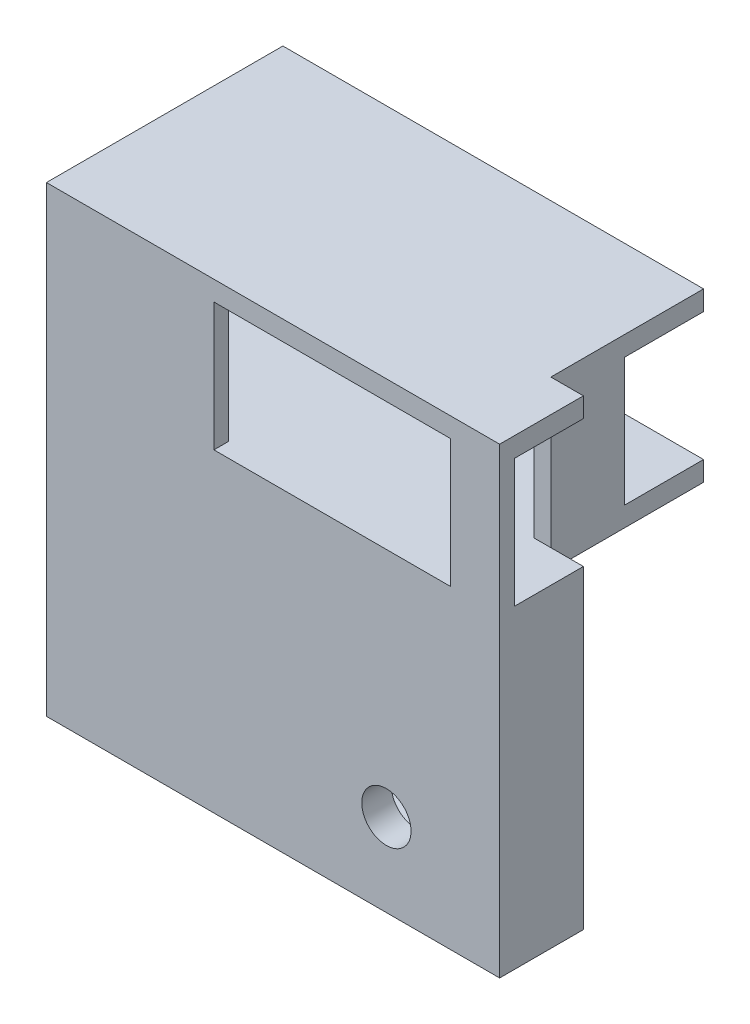
ISO-10303-21;
HEADER;
FILE_DESCRIPTION(('STEP AP214'),'2;1');
FILE_NAME('part.step','',(''),(''),'','','');
FILE_SCHEMA(('AUTOMOTIVE_DESIGN { 1 0 10303 214 1 1 1 1 }'));
ENDSEC;
DATA;
#1=APPLICATION_CONTEXT('core data for automotive mechanical design processes');
#2=APPLICATION_PROTOCOL_DEFINITION('international standard','automotive_design',2000,#1);
#3=PRODUCT_CONTEXT('',#1,'mechanical');
#4=PRODUCT('Part','Part','',(#3));
#5=PRODUCT_RELATED_PRODUCT_CATEGORY('part','',(#4));
#6=PRODUCT_DEFINITION_FORMATION('','',#4);
#7=PRODUCT_DEFINITION_CONTEXT('part definition',#1,'design');
#8=PRODUCT_DEFINITION('design','',#6,#7);
#9=PRODUCT_DEFINITION_SHAPE('','',#8);
#10=(LENGTH_UNIT() NAMED_UNIT(*) SI_UNIT(.MILLI.,.METRE.));
#11=(NAMED_UNIT(*) PLANE_ANGLE_UNIT() SI_UNIT($,.RADIAN.));
#12=(NAMED_UNIT(*) SI_UNIT($,.STERADIAN.) SOLID_ANGLE_UNIT());
#13=UNCERTAINTY_MEASURE_WITH_UNIT(LENGTH_MEASURE(1.E-05),#10,'distance_accuracy_value','');
#14=(GEOMETRIC_REPRESENTATION_CONTEXT(3) GLOBAL_UNCERTAINTY_ASSIGNED_CONTEXT((#13)) GLOBAL_UNIT_ASSIGNED_CONTEXT((#10,
#11,#12)) REPRESENTATION_CONTEXT('',''));
#15=CARTESIAN_POINT('',(0.,0.,0.));
#16=DIRECTION('',(0.,0.,1.));
#17=DIRECTION('',(1.,0.,0.));
#18=AXIS2_PLACEMENT_3D('',#15,#16,#17);
#19=CARTESIAN_POINT('',(0.,0.,0.));
#20=DIRECTION('',(0.,0.,-1.));
#21=DIRECTION('',(-1.,0.,0.));
#22=AXIS2_PLACEMENT_3D('',#19,#20,#21);
#23=PLANE('',#22);
#24=CARTESIAN_POINT('',(-26.6,3.,0.));
#25=DIRECTION('',(0.,0.,-1.));
#26=DIRECTION('',(-1.,0.,0.));
#27=AXIS2_PLACEMENT_3D('',#24,#25,#26);
#28=CIRCLE('',#27,1.);
#29=CARTESIAN_POINT('',(-27.6,3.,0.));
#30=VERTEX_POINT('',#29);
#31=EDGE_CURVE('E12',#30,#30,#28,.T.);
#32=ORIENTED_EDGE('',*,*,#31,.F.);
#33=EDGE_LOOP('',(#32));
#34=FACE_BOUND('',#33,.T.);
#35=CARTESIAN_POINT('',(-26.6,10.,0.));
#36=DIRECTION('',(0.,0.,-1.));
#37=DIRECTION('',(-1.,0.,0.));
#38=AXIS2_PLACEMENT_3D('',#35,#36,#37);
#39=CIRCLE('',#38,1.);
#40=CARTESIAN_POINT('',(-27.6,10.,0.));
#41=VERTEX_POINT('',#40);
#42=EDGE_CURVE('E73',#41,#41,#39,.T.);
#43=ORIENTED_EDGE('',*,*,#42,.F.);
#44=EDGE_LOOP('',(#43));
#45=FACE_BOUND('',#44,.T.);
#46=DIRECTION('',(1.,0.,0.));
#47=VECTOR('',#46,1.);
#48=CARTESIAN_POINT('',(-29.,0.,0.));
#49=LINE('',#48,#47);
#50=CARTESIAN_POINT('',(-38.,0.,0.));
#51=VERTEX_POINT('',#50);
#52=CARTESIAN_POINT('',(-24.,0.,0.));
#53=VERTEX_POINT('',#52);
#54=EDGE_CURVE('E433',#51,#53,#49,.T.);
#55=ORIENTED_EDGE('',*,*,#54,.F.);
#56=DIRECTION('',(0.,1.,0.));
#57=VECTOR('',#56,1.);
#58=CARTESIAN_POINT('',(-38.,0.,0.));
#59=LINE('',#58,#57);
#60=CARTESIAN_POINT('',(-38.,13.,0.));
#61=VERTEX_POINT('',#60);
#62=EDGE_CURVE('E325',#51,#61,#59,.T.);
#63=ORIENTED_EDGE('',*,*,#62,.T.);
#64=DIRECTION('',(-1.,0.,0.));
#65=VECTOR('',#64,1.);
#66=CARTESIAN_POINT('',(-29.,13.,0.));
#67=LINE('',#66,#65);
#68=CARTESIAN_POINT('',(-24.,13.,0.));
#69=VERTEX_POINT('',#68);
#70=EDGE_CURVE('E408',#69,#61,#67,.T.);
#71=ORIENTED_EDGE('',*,*,#70,.F.);
#72=DIRECTION('',(0.,1.,0.));
#73=VECTOR('',#72,1.);
#74=CARTESIAN_POINT('',(-24.,0.,0.));
#75=LINE('',#74,#73);
#76=EDGE_CURVE('E459',#53,#69,#75,.T.);
#77=ORIENTED_EDGE('',*,*,#76,.F.);
#78=EDGE_LOOP('',(#55,#63,#71,#77));
#79=FACE_BOUND('',#78,.T.);
#80=ADVANCED_FACE('F64',(#34,#45,#79),#23,.T.);
#81=CARTESIAN_POINT('',(5.00000000000001,-2.,1.5));
#82=DIRECTION('',(0.,-1.,0.));
#83=DIRECTION('',(1.,0.,0.));
#84=AXIS2_PLACEMENT_3D('',#81,#82,#83);
#85=PLANE('',#84);
#86=DIRECTION('',(1.,0.,0.));
#87=VECTOR('',#86,1.);
#88=CARTESIAN_POINT('',(0.,-2.,-7.));
#89=LINE('',#88,#87);
#90=CARTESIAN_POINT('',(-38.,-2.,-7.));
#91=VERTEX_POINT('',#90);
#92=CARTESIAN_POINT('',(1.69830011454754,-2.,-7.));
#93=VERTEX_POINT('',#92);
#94=EDGE_CURVE('E708',#91,#93,#89,.T.);
#95=ORIENTED_EDGE('',*,*,#94,.F.);
#96=DIRECTION('',(0.,0.,-1.));
#97=VECTOR('',#96,1.);
#98=CARTESIAN_POINT('',(-38.,-2.00000000000001,1.5));
#99=LINE('',#98,#97);
#100=CARTESIAN_POINT('',(-38.,-2.00000000000001,-22.5));
#101=VERTEX_POINT('',#100);
#102=EDGE_CURVE('E332',#91,#101,#99,.T.);
#103=ORIENTED_EDGE('',*,*,#102,.T.);
#104=DIRECTION('',(-1.,0.,0.));
#105=VECTOR('',#104,1.);
#106=CARTESIAN_POINT('',(0.,-2.00000000000001,-22.5));
#107=LINE('',#106,#105);
#108=CARTESIAN_POINT('',(1.69830011454754,-2.00000000000001,-22.5));
#109=VERTEX_POINT('',#108);
#110=EDGE_CURVE('E301',#109,#101,#107,.T.);
#111=ORIENTED_EDGE('',*,*,#110,.F.);
#112=DIRECTION('',(0.,0.,1.));
#113=VECTOR('',#112,1.);
#114=CARTESIAN_POINT('',(1.69830011454754,-2.00000000000001,-22.5));
#115=LINE('',#114,#113);
#116=EDGE_CURVE('E387',#109,#93,#115,.T.);
#117=ORIENTED_EDGE('',*,*,#116,.T.);
#118=EDGE_LOOP('',(#95,#103,#111,#117));
#119=FACE_BOUND('',#118,.T.);
#120=ADVANCED_FACE('F66',(#119),#85,.T.);
#121=CARTESIAN_POINT('',(0.,0.,1.5));
#122=DIRECTION('',(0.,-1.,0.));
#123=DIRECTION('',(0.,0.,-1.));
#124=AXIS2_PLACEMENT_3D('',#121,#122,#123);
#125=PLANE('',#124);
#126=DIRECTION('',(0.,0.,-1.));
#127=VECTOR('',#126,1.);
#128=CARTESIAN_POINT('',(-38.,0.,1.5));
#129=LINE('',#128,#127);
#130=CARTESIAN_POINT('',(-38.,0.,-22.5));
#131=VERTEX_POINT('',#130);
#132=EDGE_CURVE('E329',#51,#131,#129,.T.);
#133=ORIENTED_EDGE('',*,*,#132,.F.);
#134=ORIENTED_EDGE('',*,*,#54,.T.);
#135=DIRECTION('',(0.,0.,-1.));
#136=VECTOR('',#135,1.);
#137=CARTESIAN_POINT('',(-24.,0.,1.5));
#138=LINE('',#137,#136);
#139=CARTESIAN_POINT('',(-24.,0.,1.5));
#140=VERTEX_POINT('',#139);
#141=EDGE_CURVE('E476',#140,#53,#138,.T.);
#142=ORIENTED_EDGE('',*,*,#141,.F.);
#143=DIRECTION('',(-1.,0.,0.));
#144=VECTOR('',#143,1.);
#145=CARTESIAN_POINT('',(0.,0.,1.5));
#146=LINE('',#145,#144);
#147=CARTESIAN_POINT('',(0.,0.,1.5));
#148=VERTEX_POINT('',#147);
#149=EDGE_CURVE('E460',#148,#140,#146,.T.);
#150=ORIENTED_EDGE('',*,*,#149,.F.);
#151=DIRECTION('',(0.,0.,-1.));
#152=VECTOR('',#151,1.);
#153=CARTESIAN_POINT('',(0.,0.,1.5));
#154=LINE('',#153,#152);
#155=CARTESIAN_POINT('',(0.,0.,0.));
#156=VERTEX_POINT('',#155);
#157=EDGE_CURVE('E482',#148,#156,#154,.T.);
#158=ORIENTED_EDGE('',*,*,#157,.T.);
#159=CARTESIAN_POINT('',(5.00000000000001,0.,0.));
#160=VERTEX_POINT('',#159);
#161=EDGE_CURVE('E428',#156,#160,#49,.T.);
#162=ORIENTED_EDGE('',*,*,#161,.T.);
#163=DIRECTION('',(0.,0.,1.));
#164=VECTOR('',#163,1.);
#165=CARTESIAN_POINT('',(5.00000000000001,0.,-7.));
#166=LINE('',#165,#164);
#167=CARTESIAN_POINT('',(5.00000000000001,0.,-7.));
#168=VERTEX_POINT('',#167);
#169=EDGE_CURVE('E437',#168,#160,#166,.T.);
#170=ORIENTED_EDGE('',*,*,#169,.F.);
#171=DIRECTION('',(1.,0.,0.));
#172=VECTOR('',#171,1.);
#173=CARTESIAN_POINT('',(-29.,0.,-7.));
#174=LINE('',#173,#172);
#175=CARTESIAN_POINT('',(1.69830011454754,0.,-7.));
#176=VERTEX_POINT('',#175);
#177=EDGE_CURVE('E429',#176,#168,#174,.T.);
#178=ORIENTED_EDGE('',*,*,#177,.F.);
#179=CARTESIAN_POINT('',(0.,0.,-7.));
#180=VERTEX_POINT('',#179);
#181=EDGE_CURVE('E432',#180,#176,#174,.T.);
#182=ORIENTED_EDGE('',*,*,#181,.F.);
#183=DIRECTION('',(0.,0.,1.));
#184=VECTOR('',#183,1.);
#185=CARTESIAN_POINT('',(0.,0.,-22.5));
#186=LINE('',#185,#184);
#187=CARTESIAN_POINT('',(0.,0.,-14.5));
#188=VERTEX_POINT('',#187);
#189=EDGE_CURVE('E405',#188,#180,#186,.T.);
#190=ORIENTED_EDGE('',*,*,#189,.F.);
#191=DIRECTION('',(-1.,0.,0.));
#192=VECTOR('',#191,1.);
#193=CARTESIAN_POINT('',(5.00100000000001,0.,-14.5));
#194=LINE('',#193,#192);
#195=CARTESIAN_POINT('',(1.69830011454754,0.,-14.5));
#196=VERTEX_POINT('',#195);
#197=EDGE_CURVE('E358',#196,#188,#194,.T.);
#198=ORIENTED_EDGE('',*,*,#197,.F.);
#199=DIRECTION('',(0.,0.,-1.));
#200=VECTOR('',#199,1.);
#201=CARTESIAN_POINT('',(1.69830011454754,0.,-22.5));
#202=LINE('',#201,#200);
#203=CARTESIAN_POINT('',(1.69830011454754,0.,-22.5));
#204=VERTEX_POINT('',#203);
#205=EDGE_CURVE('E362',#196,#204,#202,.T.);
#206=ORIENTED_EDGE('',*,*,#205,.T.);
#207=DIRECTION('',(1.,0.,0.));
#208=VECTOR('',#207,1.);
#209=CARTESIAN_POINT('',(0.,0.,-22.5));
#210=LINE('',#209,#208);
#211=EDGE_CURVE('E371',#131,#204,#210,.T.);
#212=ORIENTED_EDGE('',*,*,#211,.F.);
#213=EDGE_LOOP('',(#133,#134,#142,#150,#158,#162,#170,#178,#182,#190,#198,#206,#212));
#214=FACE_BOUND('',#213,.T.);
#215=ADVANCED_FACE('F535',(#214),#125,.F.);
#216=CARTESIAN_POINT('',(0.,13.,1.5));
#217=DIRECTION('',(0.,-1.,0.));
#218=DIRECTION('',(0.,0.,-1.));
#219=AXIS2_PLACEMENT_3D('',#216,#217,#218);
#220=PLANE('',#219);
#221=ORIENTED_EDGE('',*,*,#70,.T.);
#222=DIRECTION('',(0.,0.,-1.));
#223=VECTOR('',#222,1.);
#224=CARTESIAN_POINT('',(-38.,13.,1.5));
#225=LINE('',#224,#223);
#226=CARTESIAN_POINT('',(-38.,13.,-22.5));
#227=VERTEX_POINT('',#226);
#228=EDGE_CURVE('E319',#61,#227,#225,.T.);
#229=ORIENTED_EDGE('',*,*,#228,.T.);
#230=DIRECTION('',(-1.,0.,0.));
#231=VECTOR('',#230,1.);
#232=CARTESIAN_POINT('',(0.,13.,-22.5));
#233=LINE('',#232,#231);
#234=CARTESIAN_POINT('',(1.69830011454754,13.,-22.5));
#235=VERTEX_POINT('',#234);
#236=EDGE_CURVE('E375',#235,#227,#233,.T.);
#237=ORIENTED_EDGE('',*,*,#236,.F.);
#238=DIRECTION('',(0.,0.,1.));
#239=VECTOR('',#238,1.);
#240=CARTESIAN_POINT('',(1.69830011454754,13.,-22.5));
#241=LINE('',#240,#239);
#242=CARTESIAN_POINT('',(1.69830011454754,13.,-14.5));
#243=VERTEX_POINT('',#242);
#244=EDGE_CURVE('E350',#235,#243,#241,.T.);
#245=ORIENTED_EDGE('',*,*,#244,.T.);
#246=DIRECTION('',(-1.,0.,0.));
#247=VECTOR('',#246,1.);
#248=CARTESIAN_POINT('',(5.00100000000001,13.,-14.5));
#249=LINE('',#248,#247);
#250=CARTESIAN_POINT('',(0.,13.,-14.5));
#251=VERTEX_POINT('',#250);
#252=EDGE_CURVE('E359',#243,#251,#249,.T.);
#253=ORIENTED_EDGE('',*,*,#252,.T.);
#254=DIRECTION('',(0.,0.,1.));
#255=VECTOR('',#254,1.);
#256=CARTESIAN_POINT('',(0.,13.,-22.5));
#257=LINE('',#256,#255);
#258=CARTESIAN_POINT('',(0.,13.,-7.));
#259=VERTEX_POINT('',#258);
#260=EDGE_CURVE('E402',#251,#259,#257,.T.);
#261=ORIENTED_EDGE('',*,*,#260,.T.);
#262=DIRECTION('',(-1.,0.,0.));
#263=VECTOR('',#262,1.);
#264=CARTESIAN_POINT('',(-29.,13.,-7.));
#265=LINE('',#264,#263);
#266=CARTESIAN_POINT('',(1.69830011454754,13.,-7.));
#267=VERTEX_POINT('',#266);
#268=EDGE_CURVE('E416',#267,#259,#265,.T.);
#269=ORIENTED_EDGE('',*,*,#268,.F.);
#270=CARTESIAN_POINT('',(5.,13.,-7.));
#271=VERTEX_POINT('',#270);
#272=EDGE_CURVE('E417',#271,#267,#265,.T.);
#273=ORIENTED_EDGE('',*,*,#272,.F.);
#274=DIRECTION('',(0.,0.,1.));
#275=VECTOR('',#274,1.);
#276=CARTESIAN_POINT('',(5.,13.,-7.));
#277=LINE('',#276,#275);
#278=CARTESIAN_POINT('',(5.00000000000001,13.,0.));
#279=VERTEX_POINT('',#278);
#280=EDGE_CURVE('E421',#271,#279,#277,.T.);
#281=ORIENTED_EDGE('',*,*,#280,.T.);
#282=CARTESIAN_POINT('',(0.,13.,0.));
#283=VERTEX_POINT('',#282);
#284=EDGE_CURVE('E413',#279,#283,#67,.T.);
#285=ORIENTED_EDGE('',*,*,#284,.T.);
#286=DIRECTION('',(0.,0.,-1.));
#287=VECTOR('',#286,1.);
#288=CARTESIAN_POINT('',(0.,13.,1.5));
#289=LINE('',#288,#287);
#290=CARTESIAN_POINT('',(0.,13.,1.5));
#291=VERTEX_POINT('',#290);
#292=EDGE_CURVE('E487',#291,#283,#289,.T.);
#293=ORIENTED_EDGE('',*,*,#292,.F.);
#294=DIRECTION('',(-1.,0.,0.));
#295=VECTOR('',#294,1.);
#296=CARTESIAN_POINT('',(0.,13.,1.5));
#297=LINE('',#296,#295);
#298=CARTESIAN_POINT('',(-24.,13.,1.5));
#299=VERTEX_POINT('',#298);
#300=EDGE_CURVE('E469',#291,#299,#297,.T.);
#301=ORIENTED_EDGE('',*,*,#300,.T.);
#302=DIRECTION('',(0.,0.,-1.));
#303=VECTOR('',#302,1.);
#304=CARTESIAN_POINT('',(-24.,13.,1.5));
#305=LINE('',#304,#303);
#306=EDGE_CURVE('E490',#299,#69,#305,.T.);
#307=ORIENTED_EDGE('',*,*,#306,.T.);
#308=EDGE_LOOP('',(#221,#229,#237,#245,#253,#261,#269,#273,#281,#285,#293,#301,#307));
#309=FACE_BOUND('',#308,.T.);
#310=ADVANCED_FACE('F553',(#309),#220,.T.);
#311=CARTESIAN_POINT('',(0.,0.,-7.));
#312=DIRECTION('',(0.,0.,1.));
#313=DIRECTION('',(1.,0.,0.));
#314=AXIS2_PLACEMENT_3D('',#311,#312,#313);
#315=PLANE('',#314);
#316=DIRECTION('',(0.,1.,0.));
#317=VECTOR('',#316,1.);
#318=CARTESIAN_POINT('',(-14.0297431718053,0.,-7.));
#319=LINE('',#318,#317);
#320=CARTESIAN_POINT('',(-14.0297431718053,-28.8426172331668,-7.));
#321=VERTEX_POINT('',#320);
#322=CARTESIAN_POINT('',(-14.0297431718053,-4.15868733058744,-7.));
#323=VERTEX_POINT('',#322);
#324=EDGE_CURVE('E702',#321,#323,#319,.T.);
#325=ORIENTED_EDGE('',*,*,#324,.F.);
#326=DIRECTION('',(-1.,0.,0.));
#327=VECTOR('',#326,1.);
#328=CARTESIAN_POINT('',(0.,-28.8426172331668,-7.));
#329=LINE('',#328,#327);
#330=CARTESIAN_POINT('',(2.72001373323372,-28.8426172331668,-7.));
#331=VERTEX_POINT('',#330);
#332=EDGE_CURVE('E699',#331,#321,#329,.T.);
#333=ORIENTED_EDGE('',*,*,#332,.F.);
#334=DIRECTION('',(0.,1.,0.));
#335=VECTOR('',#334,1.);
#336=CARTESIAN_POINT('',(2.72001373323372,0.,-7.));
#337=LINE('',#336,#335);
#338=CARTESIAN_POINT('',(2.72001373323372,-4.15868733058744,-7.));
#339=VERTEX_POINT('',#338);
#340=EDGE_CURVE('E695',#331,#339,#337,.T.);
#341=ORIENTED_EDGE('',*,*,#340,.T.);
#342=DIRECTION('',(-1.,0.,0.));
#343=VECTOR('',#342,1.);
#344=CARTESIAN_POINT('',(0.,-4.15868733058744,-7.));
#345=LINE('',#344,#343);
#346=EDGE_CURVE('E692',#339,#323,#345,.T.);
#347=ORIENTED_EDGE('',*,*,#346,.T.);
#348=EDGE_LOOP('',(#325,#333,#341,#347));
#349=FACE_BOUND('',#348,.T.);
#350=DIRECTION('',(-1.,0.,0.));
#351=VECTOR('',#350,1.);
#352=CARTESIAN_POINT('',(0.,-31.9236414496231,-7.));
#353=LINE('',#352,#351);
#354=CARTESIAN_POINT('',(5.,-31.9236414496231,-7.));
#355=VERTEX_POINT('',#354);
#356=CARTESIAN_POINT('',(-22.5,-31.9236414496231,-7.));
#357=VERTEX_POINT('',#356);
#358=EDGE_CURVE('E615',#355,#357,#353,.T.);
#359=ORIENTED_EDGE('',*,*,#358,.T.);
#360=DIRECTION('',(0.,-1.,0.));
#361=VECTOR('',#360,1.);
#362=CARTESIAN_POINT('',(-22.5,-28.7210065369621,-7.));
#363=LINE('',#362,#361);
#364=CARTESIAN_POINT('',(-22.5,-28.7210065369621,-7.));
#365=VERTEX_POINT('',#364);
#366=EDGE_CURVE('E277',#365,#357,#363,.T.);
#367=ORIENTED_EDGE('',*,*,#366,.F.);
#368=DIRECTION('',(-1.,0.,0.));
#369=VECTOR('',#368,1.);
#370=CARTESIAN_POINT('',(0.,-28.7210065369621,-7.));
#371=LINE('',#370,#369);
#372=CARTESIAN_POINT('',(-16.5,-28.7210065369621,-7.));
#373=VERTEX_POINT('',#372);
#374=EDGE_CURVE('E286',#373,#365,#371,.T.);
#375=ORIENTED_EDGE('',*,*,#374,.F.);
#376=DIRECTION('',(0.,1.,0.));
#377=VECTOR('',#376,1.);
#378=CARTESIAN_POINT('',(-16.5,0.,-7.));
#379=LINE('',#378,#377);
#380=CARTESIAN_POINT('',(-16.5,-4.15868733058744,-7.));
#381=VERTEX_POINT('',#380);
#382=EDGE_CURVE('E635',#373,#381,#379,.T.);
#383=ORIENTED_EDGE('',*,*,#382,.T.);
#384=DIRECTION('',(-1.,0.,0.));
#385=VECTOR('',#384,1.);
#386=CARTESIAN_POINT('',(0.,-4.15868733058744,-7.));
#387=LINE('',#386,#385);
#388=CARTESIAN_POINT('',(-35.6503124750276,-4.15868733058744,-7.));
#389=VERTEX_POINT('',#388);
#390=EDGE_CURVE('E689',#381,#389,#387,.T.);
#391=ORIENTED_EDGE('',*,*,#390,.T.);
#392=DIRECTION('',(0.,1.,0.));
#393=VECTOR('',#392,1.);
#394=CARTESIAN_POINT('',(-35.6503124750276,0.,-7.));
#395=LINE('',#394,#393);
#396=CARTESIAN_POINT('',(-35.6503124750276,-28.7210065369621,-7.));
#397=VERTEX_POINT('',#396);
#398=EDGE_CURVE('E686',#397,#389,#395,.T.);
#399=ORIENTED_EDGE('',*,*,#398,.F.);
#400=DIRECTION('',(-1.,0.,0.));
#401=VECTOR('',#400,1.);
#402=CARTESIAN_POINT('',(-22.5,-28.7210065369621,-7.));
#403=LINE('',#402,#401);
#404=CARTESIAN_POINT('',(-38.,-28.7210065369621,-7.));
#405=VERTEX_POINT('',#404);
#406=EDGE_CURVE('E278',#397,#405,#403,.T.);
#407=ORIENTED_EDGE('',*,*,#406,.T.);
#408=DIRECTION('',(0.,1.,0.));
#409=VECTOR('',#408,1.);
#410=CARTESIAN_POINT('',(-38.,0.,-7.));
#411=LINE('',#410,#409);
#412=EDGE_CURVE('E296',#405,#91,#411,.T.);
#413=ORIENTED_EDGE('',*,*,#412,.T.);
#414=ORIENTED_EDGE('',*,*,#94,.T.);
#415=DIRECTION('',(0.,-1.,0.));
#416=VECTOR('',#415,1.);
#417=CARTESIAN_POINT('',(1.69830011454754,0.,-7.));
#418=LINE('',#417,#416);
#419=EDGE_CURVE('E391',#176,#93,#418,.T.);
#420=ORIENTED_EDGE('',*,*,#419,.F.);
#421=ORIENTED_EDGE('',*,*,#177,.T.);
#422=DIRECTION('',(0.,-1.,0.));
#423=VECTOR('',#422,1.);
#424=CARTESIAN_POINT('',(5.00000000000001,-2.00000000000001,-7.));
#425=LINE('',#424,#423);
#426=EDGE_CURVE('E434',#168,#355,#425,.T.);
#427=ORIENTED_EDGE('',*,*,#426,.T.);
#428=EDGE_LOOP('',(#359,#367,#375,#383,#391,#399,#407,#413,#414,#420,#421,#427));
#429=FACE_BOUND('',#428,.T.);
#430=ADVANCED_FACE('F749',(#349,#429),#315,.F.);
#431=CARTESIAN_POINT('',(0.,0.,-7.));
#432=DIRECTION('',(0.,0.,-1.));
#433=DIRECTION('',(-1.,0.,0.));
#434=AXIS2_PLACEMENT_3D('',#431,#432,#433);
#435=PLANE('',#434);
#436=ORIENTED_EDGE('',*,*,#272,.T.);
#437=CARTESIAN_POINT('',(1.69830011454754,15.,-7.));
#438=VERTEX_POINT('',#437);
#439=EDGE_CURVE('E372',#438,#267,#418,.T.);
#440=ORIENTED_EDGE('',*,*,#439,.F.);
#441=DIRECTION('',(1.,0.,0.));
#442=VECTOR('',#441,1.);
#443=CARTESIAN_POINT('',(-29.,15.,-7.));
#444=LINE('',#443,#442);
#445=CARTESIAN_POINT('',(5.00000000000001,15.,-7.));
#446=VERTEX_POINT('',#445);
#447=EDGE_CURVE('E409',#438,#446,#444,.T.);
#448=ORIENTED_EDGE('',*,*,#447,.T.);
#449=DIRECTION('',(0.,-1.,0.));
#450=VECTOR('',#449,1.);
#451=CARTESIAN_POINT('',(5.,13.,-7.));
#452=LINE('',#451,#450);
#453=EDGE_CURVE('E412',#446,#271,#452,.T.);
#454=ORIENTED_EDGE('',*,*,#453,.T.);
#455=EDGE_LOOP('',(#436,#440,#448,#454));
#456=FACE_BOUND('',#455,.T.);
#457=ADVANCED_FACE('F744',(#456),#435,.T.);
#458=CARTESIAN_POINT('',(2.6,3.,0.));
#459=DIRECTION('',(0.,0.,-1.));
#460=DIRECTION('',(-1.,0.,0.));
#461=AXIS2_PLACEMENT_3D('',#458,#459,#460);
#462=CIRCLE('',#461,1.);
#463=CARTESIAN_POINT('',(1.6,3.,0.));
#464=VERTEX_POINT('',#463);
#465=EDGE_CURVE('E511',#464,#464,#462,.T.);
#466=ORIENTED_EDGE('',*,*,#465,.F.);
#467=EDGE_LOOP('',(#466));
#468=FACE_BOUND('',#467,.T.);
#469=CARTESIAN_POINT('',(2.6,10.,0.));
#470=DIRECTION('',(0.,0.,-1.));
#471=DIRECTION('',(-1.,0.,0.));
#472=AXIS2_PLACEMENT_3D('',#469,#470,#471);
#473=CIRCLE('',#472,1.);
#474=CARTESIAN_POINT('',(1.6,10.,0.));
#475=VERTEX_POINT('',#474);
#476=EDGE_CURVE('E515',#475,#475,#473,.T.);
#477=ORIENTED_EDGE('',*,*,#476,.F.);
#478=EDGE_LOOP('',(#477));
#479=FACE_BOUND('',#478,.T.);
#480=DIRECTION('',(0.,1.,0.));
#481=VECTOR('',#480,1.);
#482=CARTESIAN_POINT('',(0.,0.,0.));
#483=LINE('',#482,#481);
#484=EDGE_CURVE('E465',#156,#283,#483,.T.);
#485=ORIENTED_EDGE('',*,*,#484,.T.);
#486=ORIENTED_EDGE('',*,*,#284,.F.);
#487=DIRECTION('',(0.,1.,0.));
#488=VECTOR('',#487,1.);
#489=CARTESIAN_POINT('',(5.00000000000001,-2.,0.));
#490=LINE('',#489,#488);
#491=EDGE_CURVE('E486',#160,#279,#490,.T.);
#492=ORIENTED_EDGE('',*,*,#491,.F.);
#493=ORIENTED_EDGE('',*,*,#161,.F.);
#494=EDGE_LOOP('',(#485,#486,#492,#493));
#495=FACE_BOUND('',#494,.T.);
#496=ADVANCED_FACE('F528',(#468,#479,#495),#23,.T.);
#497=CARTESIAN_POINT('',(5.00000000000001,-2.,1.5));
#498=DIRECTION('',(-1.,0.,0.));
#499=DIRECTION('',(0.,0.,1.));
#500=AXIS2_PLACEMENT_3D('',#497,#498,#499);
#501=PLANE('',#500);
#502=DIRECTION('',(0.,0.,1.));
#503=VECTOR('',#502,1.);
#504=CARTESIAN_POINT('',(5.00000000000001,-31.9236414496231,-1.5));
#505=LINE('',#504,#503);
#506=CARTESIAN_POINT('',(5.00000000000001,-31.9236414496231,1.5));
#507=VERTEX_POINT('',#506);
#508=EDGE_CURVE('E310',#355,#507,#505,.T.);
#509=ORIENTED_EDGE('',*,*,#508,.F.);
#510=ORIENTED_EDGE('',*,*,#426,.F.);
#511=ORIENTED_EDGE('',*,*,#169,.T.);
#512=ORIENTED_EDGE('',*,*,#491,.T.);
#513=ORIENTED_EDGE('',*,*,#280,.F.);
#514=ORIENTED_EDGE('',*,*,#453,.F.);
#515=DIRECTION('',(0.,0.,-1.));
#516=VECTOR('',#515,1.);
#517=CARTESIAN_POINT('',(5.00000000000001,15.,1.5));
#518=LINE('',#517,#516);
#519=CARTESIAN_POINT('',(5.00000000000001,15.,1.5));
#520=VERTEX_POINT('',#519);
#521=EDGE_CURVE('E504',#520,#446,#518,.T.);
#522=ORIENTED_EDGE('',*,*,#521,.F.);
#523=DIRECTION('',(0.,1.,0.));
#524=VECTOR('',#523,1.);
#525=CARTESIAN_POINT('',(5.00000000000001,-2.,1.5));
#526=LINE('',#525,#524);
#527=EDGE_CURVE('E501',#507,#520,#526,.T.);
#528=ORIENTED_EDGE('',*,*,#527,.F.);
#529=EDGE_LOOP('',(#509,#510,#511,#512,#513,#514,#522,#528));
#530=FACE_BOUND('',#529,.T.);
#531=ADVANCED_FACE('F560',(#530),#501,.F.);
#532=CARTESIAN_POINT('',(5.00000000000001,15.,1.5));
#533=DIRECTION('',(0.,-1.,0.));
#534=DIRECTION('',(1.,0.,0.));
#535=AXIS2_PLACEMENT_3D('',#532,#533,#534);
#536=PLANE('',#535);
#537=DIRECTION('',(0.,0.,-1.));
#538=VECTOR('',#537,1.);
#539=CARTESIAN_POINT('',(-41.,15.,-22.5));
#540=LINE('',#539,#538);
#541=CARTESIAN_POINT('',(-41.,15.,1.5));
#542=VERTEX_POINT('',#541);
#543=CARTESIAN_POINT('',(-41.,15.,-22.5));
#544=VERTEX_POINT('',#543);
#545=EDGE_CURVE('E342',#542,#544,#540,.T.);
#546=ORIENTED_EDGE('',*,*,#545,.F.);
#547=DIRECTION('',(-1.,0.,0.));
#548=VECTOR('',#547,1.);
#549=CARTESIAN_POINT('',(5.00000000000001,15.,1.5));
#550=LINE('',#549,#548);
#551=EDGE_CURVE('E497',#520,#542,#550,.T.);
#552=ORIENTED_EDGE('',*,*,#551,.F.);
#553=ORIENTED_EDGE('',*,*,#521,.T.);
#554=ORIENTED_EDGE('',*,*,#447,.F.);
#555=DIRECTION('',(0.,0.,1.));
#556=VECTOR('',#555,1.);
#557=CARTESIAN_POINT('',(1.69830011454754,15.,-22.5));
#558=LINE('',#557,#556);
#559=CARTESIAN_POINT('',(1.69830011454754,15.,-22.5));
#560=VERTEX_POINT('',#559);
#561=EDGE_CURVE('E399',#560,#438,#558,.T.);
#562=ORIENTED_EDGE('',*,*,#561,.F.);
#563=DIRECTION('',(-1.,0.,0.));
#564=VECTOR('',#563,1.);
#565=CARTESIAN_POINT('',(0.,15.,-22.5));
#566=LINE('',#565,#564);
#567=EDGE_CURVE('E379',#560,#544,#566,.T.);
#568=ORIENTED_EDGE('',*,*,#567,.T.);
#569=EDGE_LOOP('',(#546,#552,#553,#554,#562,#568));
#570=FACE_BOUND('',#569,.T.);
#571=ADVANCED_FACE('F602',(#570),#536,.F.);
#572=CARTESIAN_POINT('',(0.,0.,1.5));
#573=DIRECTION('',(0.,0.,-1.));
#574=DIRECTION('',(-1.,0.,0.));
#575=AXIS2_PLACEMENT_3D('',#572,#573,#574);
#576=PLANE('',#575);
#577=CARTESIAN_POINT('',(-6.49364567287342,-23.5226601259213,1.5));
#578=DIRECTION('',(0.,0.,1.));
#579=DIRECTION('',(1.,0.,0.));
#580=AXIS2_PLACEMENT_3D('',#577,#578,#579);
#581=CIRCLE('',#580,2.5);
#582=CARTESIAN_POINT('',(-3.99364567287342,-23.5226601259213,1.5));
#583=VERTEX_POINT('',#582);
#584=EDGE_CURVE('E717',#583,#583,#581,.T.);
#585=ORIENTED_EDGE('',*,*,#584,.F.);
#586=EDGE_LOOP('',(#585));
#587=FACE_BOUND('',#586,.T.);
#588=ORIENTED_EDGE('',*,*,#551,.T.);
#589=DIRECTION('',(0.,1.,0.));
#590=VECTOR('',#589,1.);
#591=CARTESIAN_POINT('',(-41.,15.,1.5));
#592=LINE('',#591,#590);
#593=CARTESIAN_POINT('',(-41.,-31.9236414496231,1.5));
#594=VERTEX_POINT('',#593);
#595=EDGE_CURVE('E339',#594,#542,#592,.T.);
#596=ORIENTED_EDGE('',*,*,#595,.F.);
#597=DIRECTION('',(-1.,0.,0.));
#598=VECTOR('',#597,1.);
#599=CARTESIAN_POINT('',(-38.,-31.9236414496231,1.5));
#600=LINE('',#599,#598);
#601=EDGE_CURVE('E315',#507,#594,#600,.T.);
#602=ORIENTED_EDGE('',*,*,#601,.F.);
#603=ORIENTED_EDGE('',*,*,#527,.T.);
#604=EDGE_LOOP('',(#588,#596,#602,#603));
#605=FACE_BOUND('',#604,.T.);
#606=DIRECTION('',(0.,1.,0.));
#607=VECTOR('',#606,1.);
#608=CARTESIAN_POINT('',(0.,0.,1.5));
#609=LINE('',#608,#607);
#610=EDGE_CURVE('E473',#148,#291,#609,.T.);
#611=ORIENTED_EDGE('',*,*,#610,.F.);
#612=ORIENTED_EDGE('',*,*,#149,.T.);
#613=DIRECTION('',(0.,1.,0.));
#614=VECTOR('',#613,1.);
#615=CARTESIAN_POINT('',(-24.,0.,1.5));
#616=LINE('',#615,#614);
#617=EDGE_CURVE('E464',#140,#299,#616,.T.);
#618=ORIENTED_EDGE('',*,*,#617,.T.);
#619=ORIENTED_EDGE('',*,*,#300,.F.);
#620=EDGE_LOOP('',(#611,#612,#618,#619));
#621=FACE_BOUND('',#620,.T.);
#622=ADVANCED_FACE('F544',(#587,#605,#621),#576,.F.);
#623=CARTESIAN_POINT('',(0.,0.,1.5));
#624=DIRECTION('',(-1.,0.,0.));
#625=DIRECTION('',(0.,0.,1.));
#626=AXIS2_PLACEMENT_3D('',#623,#624,#625);
#627=PLANE('',#626);
#628=ORIENTED_EDGE('',*,*,#484,.F.);
#629=ORIENTED_EDGE('',*,*,#157,.F.);
#630=ORIENTED_EDGE('',*,*,#610,.T.);
#631=ORIENTED_EDGE('',*,*,#292,.T.);
#632=EDGE_LOOP('',(#628,#629,#630,#631));
#633=FACE_BOUND('',#632,.T.);
#634=ADVANCED_FACE('F548',(#633),#627,.T.);
#635=CARTESIAN_POINT('',(-24.,0.,1.5));
#636=DIRECTION('',(-1.,0.,0.));
#637=DIRECTION('',(0.,0.,1.));
#638=AXIS2_PLACEMENT_3D('',#635,#636,#637);
#639=PLANE('',#638);
#640=ORIENTED_EDGE('',*,*,#76,.T.);
#641=ORIENTED_EDGE('',*,*,#306,.F.);
#642=ORIENTED_EDGE('',*,*,#617,.F.);
#643=ORIENTED_EDGE('',*,*,#141,.T.);
#644=EDGE_LOOP('',(#640,#641,#642,#643));
#645=FACE_BOUND('',#644,.T.);
#646=ADVANCED_FACE('F540',(#645),#639,.F.);
#647=CARTESIAN_POINT('',(2.6,3.,0.));
#648=DIRECTION('',(0.,0.,1.));
#649=DIRECTION('',(1.,0.,0.));
#650=AXIS2_PLACEMENT_3D('',#647,#648,#649);
#651=CONICAL_SURFACE('',#650,1.,0.750491578357562);
#652=CARTESIAN_POINT('',(2.6,3.,-1.));
#653=DIRECTION('',(0.,0.,1.));
#654=DIRECTION('',(1.,0.,0.));
#655=AXIS2_PLACEMENT_3D('',#652,#653,#654);
#656=CIRCLE('',#655,0.0674849138623372);
#657=CARTESIAN_POINT('',(2.66748491386234,3.,-1.));
#658=VERTEX_POINT('',#657);
#659=EDGE_CURVE('E455',#658,#658,#656,.T.);
#660=ORIENTED_EDGE('',*,*,#659,.T.);
#661=EDGE_LOOP('',(#660));
#662=FACE_BOUND('',#661,.T.);
#663=ORIENTED_EDGE('',*,*,#465,.T.);
#664=EDGE_LOOP('',(#663));
#665=FACE_BOUND('',#664,.T.);
#666=ADVANCED_FACE('F768',(#662,#665),#651,.T.);
#667=CARTESIAN_POINT('',(2.6,3.,-1.));
#668=DIRECTION('',(0.,0.,1.));
#669=DIRECTION('',(1.,0.,0.));
#670=AXIS2_PLACEMENT_3D('',#667,#668,#669);
#671=PLANE('',#670);
#672=ORIENTED_EDGE('',*,*,#659,.F.);
#673=EDGE_LOOP('',(#672));
#674=FACE_BOUND('',#673,.T.);
#675=ADVANCED_FACE('F759',(#674),#671,.F.);
#676=CARTESIAN_POINT('',(2.6,10.,0.));
#677=DIRECTION('',(0.,0.,1.));
#678=DIRECTION('',(1.,0.,0.));
#679=AXIS2_PLACEMENT_3D('',#676,#677,#678);
#680=CONICAL_SURFACE('',#679,1.,0.750491578357562);
#681=CARTESIAN_POINT('',(2.6,10.,-1.));
#682=DIRECTION('',(0.,0.,1.));
#683=DIRECTION('',(1.,0.,0.));
#684=AXIS2_PLACEMENT_3D('',#681,#682,#683);
#685=CIRCLE('',#684,0.0674849138623373);
#686=CARTESIAN_POINT('',(2.66748491386234,10.,-1.));
#687=VERTEX_POINT('',#686);
#688=EDGE_CURVE('E451',#687,#687,#685,.T.);
#689=ORIENTED_EDGE('',*,*,#688,.T.);
#690=EDGE_LOOP('',(#689));
#691=FACE_BOUND('',#690,.T.);
#692=ORIENTED_EDGE('',*,*,#476,.T.);
#693=EDGE_LOOP('',(#692));
#694=FACE_BOUND('',#693,.T.);
#695=ADVANCED_FACE('F756',(#691,#694),#680,.T.);
#696=CARTESIAN_POINT('',(2.6,10.,-1.));
#697=DIRECTION('',(0.,0.,1.));
#698=DIRECTION('',(1.,0.,0.));
#699=AXIS2_PLACEMENT_3D('',#696,#697,#698);
#700=PLANE('',#699);
#701=ORIENTED_EDGE('',*,*,#688,.F.);
#702=EDGE_LOOP('',(#701));
#703=FACE_BOUND('',#702,.T.);
#704=ADVANCED_FACE('F758',(#703),#700,.F.);
#705=CARTESIAN_POINT('',(-26.6,10.,0.));
#706=DIRECTION('',(0.,0.,1.));
#707=DIRECTION('',(1.,0.,0.));
#708=AXIS2_PLACEMENT_3D('',#705,#706,#707);
#709=CONICAL_SURFACE('',#708,1.,0.750491578357562);
#710=CARTESIAN_POINT('',(-26.6,10.,-1.));
#711=DIRECTION('',(0.,0.,1.));
#712=DIRECTION('',(1.,0.,0.));
#713=AXIS2_PLACEMENT_3D('',#710,#711,#712);
#714=CIRCLE('',#713,0.0674849138623387);
#715=CARTESIAN_POINT('',(-26.5325150861377,10.,-1.));
#716=VERTEX_POINT('',#715);
#717=EDGE_CURVE('E447',#716,#716,#714,.T.);
#718=ORIENTED_EDGE('',*,*,#717,.T.);
#719=EDGE_LOOP('',(#718));
#720=FACE_BOUND('',#719,.T.);
#721=ORIENTED_EDGE('',*,*,#42,.T.);
#722=EDGE_LOOP('',(#721));
#723=FACE_BOUND('',#722,.T.);
#724=ADVANCED_FACE('F522',(#720,#723),#709,.T.);
#725=CARTESIAN_POINT('',(-26.6,10.,-1.));
#726=DIRECTION('',(0.,0.,1.));
#727=DIRECTION('',(1.,0.,0.));
#728=AXIS2_PLACEMENT_3D('',#725,#726,#727);
#729=PLANE('',#728);
#730=ORIENTED_EDGE('',*,*,#717,.F.);
#731=EDGE_LOOP('',(#730));
#732=FACE_BOUND('',#731,.T.);
#733=ADVANCED_FACE('F810',(#732),#729,.F.);
#734=CARTESIAN_POINT('',(-26.6,3.,0.));
#735=DIRECTION('',(0.,0.,1.));
#736=DIRECTION('',(1.,0.,0.));
#737=AXIS2_PLACEMENT_3D('',#734,#735,#736);
#738=CONICAL_SURFACE('',#737,1.,0.750491578357562);
#739=CARTESIAN_POINT('',(-26.6,3.,-1.));
#740=DIRECTION('',(0.,0.,1.));
#741=DIRECTION('',(1.,0.,0.));
#742=AXIS2_PLACEMENT_3D('',#739,#740,#741);
#743=CIRCLE('',#742,0.0674849138623384);
#744=CARTESIAN_POINT('',(-26.5325150861377,3.,-1.));
#745=VERTEX_POINT('',#744);
#746=EDGE_CURVE('E443',#745,#745,#743,.T.);
#747=ORIENTED_EDGE('',*,*,#746,.T.);
#748=EDGE_LOOP('',(#747));
#749=FACE_BOUND('',#748,.T.);
#750=ORIENTED_EDGE('',*,*,#31,.T.);
#751=EDGE_LOOP('',(#750));
#752=FACE_BOUND('',#751,.T.);
#753=ADVANCED_FACE('F819',(#749,#752),#738,.T.);
#754=CARTESIAN_POINT('',(-26.6,3.,-1.));
#755=DIRECTION('',(0.,0.,1.));
#756=DIRECTION('',(1.,0.,0.));
#757=AXIS2_PLACEMENT_3D('',#754,#755,#756);
#758=PLANE('',#757);
#759=ORIENTED_EDGE('',*,*,#746,.F.);
#760=EDGE_LOOP('',(#759));
#761=FACE_BOUND('',#760,.T.);
#762=ADVANCED_FACE('F829',(#761),#758,.F.);
#763=CARTESIAN_POINT('',(0.,0.,-7.));
#764=DIRECTION('',(0.,0.,-1.));
#765=DIRECTION('',(-1.,0.,0.));
#766=AXIS2_PLACEMENT_3D('',#763,#764,#765);
#767=PLANE('',#766);
#768=DIRECTION('',(0.,-1.,0.));
#769=VECTOR('',#768,1.);
#770=CARTESIAN_POINT('',(0.,0.,-7.));
#771=LINE('',#770,#769);
#772=EDGE_CURVE('E368',#259,#180,#771,.T.);
#773=ORIENTED_EDGE('',*,*,#772,.T.);
#774=ORIENTED_EDGE('',*,*,#181,.T.);
#775=EDGE_CURVE('E395',#267,#176,#418,.T.);
#776=ORIENTED_EDGE('',*,*,#775,.F.);
#777=ORIENTED_EDGE('',*,*,#268,.T.);
#778=EDGE_LOOP('',(#773,#774,#776,#777));
#779=FACE_BOUND('',#778,.T.);
#780=ADVANCED_FACE('F570',(#779),#767,.F.);
#781=CARTESIAN_POINT('',(0.,0.,-22.5));
#782=DIRECTION('',(-1.,0.,0.));
#783=DIRECTION('',(0.,0.,1.));
#784=AXIS2_PLACEMENT_3D('',#781,#782,#783);
#785=PLANE('',#784);
#786=DIRECTION('',(0.,1.,0.));
#787=VECTOR('',#786,1.);
#788=CARTESIAN_POINT('',(0.,13.,-14.5));
#789=LINE('',#788,#787);
#790=EDGE_CURVE('E354',#188,#251,#789,.T.);
#791=ORIENTED_EDGE('',*,*,#790,.F.);
#792=ORIENTED_EDGE('',*,*,#189,.T.);
#793=ORIENTED_EDGE('',*,*,#772,.F.);
#794=ORIENTED_EDGE('',*,*,#260,.F.);
#795=EDGE_LOOP('',(#791,#792,#793,#794));
#796=FACE_BOUND('',#795,.T.);
#797=ADVANCED_FACE('F589',(#796),#785,.T.);
#798=CARTESIAN_POINT('',(1.69830011454754,0.,-22.5));
#799=DIRECTION('',(-1.,0.,0.));
#800=DIRECTION('',(0.,0.,1.));
#801=AXIS2_PLACEMENT_3D('',#798,#799,#800);
#802=PLANE('',#801);
#803=DIRECTION('',(0.,-1.,0.));
#804=VECTOR('',#803,1.);
#805=CARTESIAN_POINT('',(1.69830011454754,13.,-14.5));
#806=LINE('',#805,#804);
#807=EDGE_CURVE('E346',#243,#196,#806,.T.);
#808=ORIENTED_EDGE('',*,*,#807,.F.);
#809=ORIENTED_EDGE('',*,*,#244,.F.);
#810=DIRECTION('',(0.,-1.,0.));
#811=VECTOR('',#810,1.);
#812=CARTESIAN_POINT('',(1.69830011454754,0.,-22.5));
#813=LINE('',#812,#811);
#814=EDGE_CURVE('E383',#560,#235,#813,.T.);
#815=ORIENTED_EDGE('',*,*,#814,.F.);
#816=ORIENTED_EDGE('',*,*,#561,.T.);
#817=ORIENTED_EDGE('',*,*,#439,.T.);
#818=ORIENTED_EDGE('',*,*,#775,.T.);
#819=ORIENTED_EDGE('',*,*,#419,.T.);
#820=ORIENTED_EDGE('',*,*,#116,.F.);
#821=EDGE_CURVE('E382',#204,#109,#813,.T.);
#822=ORIENTED_EDGE('',*,*,#821,.F.);
#823=ORIENTED_EDGE('',*,*,#205,.F.);
#824=EDGE_LOOP('',(#808,#809,#815,#816,#817,#818,#819,#820,#822,#823));
#825=FACE_BOUND('',#824,.T.);
#826=ADVANCED_FACE('F577',(#825),#802,.F.);
#827=CARTESIAN_POINT('',(0.,0.,-22.5));
#828=DIRECTION('',(0.,0.,-1.));
#829=DIRECTION('',(-1.,0.,0.));
#830=AXIS2_PLACEMENT_3D('',#827,#828,#829);
#831=PLANE('',#830);
#832=DIRECTION('',(-1.,0.,0.));
#833=VECTOR('',#832,1.);
#834=CARTESIAN_POINT('',(-38.,-31.9236414496231,-22.5));
#835=LINE('',#834,#833);
#836=CARTESIAN_POINT('',(-38.,-31.9236414496231,-22.5));
#837=VERTEX_POINT('',#836);
#838=CARTESIAN_POINT('',(-41.,-31.9236414496231,-22.5));
#839=VERTEX_POINT('',#838);
#840=EDGE_CURVE('E309',#837,#839,#835,.T.);
#841=ORIENTED_EDGE('',*,*,#840,.T.);
#842=DIRECTION('',(0.,-1.,0.));
#843=VECTOR('',#842,1.);
#844=CARTESIAN_POINT('',(-41.,13.,-22.5));
#845=LINE('',#844,#843);
#846=EDGE_CURVE('E335',#544,#839,#845,.T.);
#847=ORIENTED_EDGE('',*,*,#846,.F.);
#848=ORIENTED_EDGE('',*,*,#567,.F.);
#849=ORIENTED_EDGE('',*,*,#814,.T.);
#850=ORIENTED_EDGE('',*,*,#236,.T.);
#851=DIRECTION('',(0.,-1.,0.));
#852=VECTOR('',#851,1.);
#853=CARTESIAN_POINT('',(-38.,0.,-22.5));
#854=LINE('',#853,#852);
#855=EDGE_CURVE('E303',#227,#131,#854,.T.);
#856=ORIENTED_EDGE('',*,*,#855,.T.);
#857=ORIENTED_EDGE('',*,*,#211,.T.);
#858=ORIENTED_EDGE('',*,*,#821,.T.);
#859=ORIENTED_EDGE('',*,*,#110,.T.);
#860=CARTESIAN_POINT('',(-38.,-28.7210065369621,-22.5));
#861=VERTEX_POINT('',#860);
#862=EDGE_CURVE('E294',#101,#861,#854,.T.);
#863=ORIENTED_EDGE('',*,*,#862,.T.);
#864=DIRECTION('',(0.,-1.,0.));
#865=VECTOR('',#864,1.);
#866=CARTESIAN_POINT('',(-38.,-28.7210065369621,-22.5));
#867=LINE('',#866,#865);
#868=EDGE_CURVE('E265',#861,#837,#867,.T.);
#869=ORIENTED_EDGE('',*,*,#868,.T.);
#870=EDGE_LOOP('',(#841,#847,#848,#849,#850,#856,#857,#858,#859,#863,#869));
#871=FACE_BOUND('',#870,.T.);
#872=ADVANCED_FACE('F299',(#871),#831,.T.);
#873=CARTESIAN_POINT('',(5.00100000000001,13.,-14.5));
#874=DIRECTION('',(0.,0.,1.));
#875=DIRECTION('',(0.,-1.,0.));
#876=AXIS2_PLACEMENT_3D('',#873,#874,#875);
#877=PLANE('',#876);
#878=ORIENTED_EDGE('',*,*,#807,.T.);
#879=ORIENTED_EDGE('',*,*,#197,.T.);
#880=ORIENTED_EDGE('',*,*,#790,.T.);
#881=ORIENTED_EDGE('',*,*,#252,.F.);
#882=EDGE_LOOP('',(#878,#879,#880,#881));
#883=FACE_BOUND('',#882,.T.);
#884=ADVANCED_FACE('F593',(#883),#877,.F.);
#885=CARTESIAN_POINT('',(-41.,0.,0.));
#886=DIRECTION('',(1.,0.,0.));
#887=DIRECTION('',(0.,0.,-1.));
#888=AXIS2_PLACEMENT_3D('',#885,#886,#887);
#889=PLANE('',#888);
#890=ORIENTED_EDGE('',*,*,#595,.T.);
#891=ORIENTED_EDGE('',*,*,#545,.T.);
#892=ORIENTED_EDGE('',*,*,#846,.T.);
#893=DIRECTION('',(0.,0.,-1.));
#894=VECTOR('',#893,1.);
#895=CARTESIAN_POINT('',(-41.,-31.9236414496231,0.));
#896=LINE('',#895,#894);
#897=EDGE_CURVE('E304',#594,#839,#896,.T.);
#898=ORIENTED_EDGE('',*,*,#897,.F.);
#899=EDGE_LOOP('',(#890,#891,#892,#898));
#900=FACE_BOUND('',#899,.T.);
#901=ADVANCED_FACE('F606',(#900),#889,.F.);
#902=CARTESIAN_POINT('',(-38.,0.,0.));
#903=DIRECTION('',(-1.,0.,0.));
#904=DIRECTION('',(0.,0.,1.));
#905=AXIS2_PLACEMENT_3D('',#902,#903,#904);
#906=PLANE('',#905);
#907=ORIENTED_EDGE('',*,*,#62,.F.);
#908=ORIENTED_EDGE('',*,*,#132,.T.);
#909=ORIENTED_EDGE('',*,*,#855,.F.);
#910=ORIENTED_EDGE('',*,*,#228,.F.);
#911=EDGE_LOOP('',(#907,#908,#909,#910));
#912=FACE_BOUND('',#911,.T.);
#913=ADVANCED_FACE('F596',(#912),#906,.F.);
#914=CARTESIAN_POINT('',(-38.,-31.9236414496231,0.));
#915=DIRECTION('',(0.,1.,0.));
#916=DIRECTION('',(0.,0.,1.));
#917=AXIS2_PLACEMENT_3D('',#914,#915,#916);
#918=PLANE('',#917);
#919=ORIENTED_EDGE('',*,*,#840,.F.);
#920=DIRECTION('',(0.707106781186546,0.,0.707106781186549));
#921=VECTOR('',#920,1.);
#922=CARTESIAN_POINT('',(-38.,-31.9236414496231,-22.5));
#923=LINE('',#922,#921);
#924=EDGE_CURVE('E271',#837,#357,#923,.T.);
#925=ORIENTED_EDGE('',*,*,#924,.T.);
#926=ORIENTED_EDGE('',*,*,#358,.F.);
#927=ORIENTED_EDGE('',*,*,#508,.T.);
#928=ORIENTED_EDGE('',*,*,#601,.T.);
#929=ORIENTED_EDGE('',*,*,#897,.T.);
#930=EDGE_LOOP('',(#919,#925,#926,#927,#928,#929));
#931=FACE_BOUND('',#930,.T.);
#932=ADVANCED_FACE('F613',(#931),#918,.F.);
#933=ORIENTED_EDGE('',*,*,#412,.F.);
#934=DIRECTION('',(0.,0.,-1.));
#935=VECTOR('',#934,1.);
#936=CARTESIAN_POINT('',(-38.,-28.7210065369621,-7.));
#937=LINE('',#936,#935);
#938=EDGE_CURVE('E283',#405,#861,#937,.T.);
#939=ORIENTED_EDGE('',*,*,#938,.T.);
#940=ORIENTED_EDGE('',*,*,#862,.F.);
#941=ORIENTED_EDGE('',*,*,#102,.F.);
#942=EDGE_LOOP('',(#933,#939,#940,#941));
#943=FACE_BOUND('',#942,.T.);
#944=ADVANCED_FACE('F292',(#943),#906,.F.);
#945=CARTESIAN_POINT('',(0.,-4.15868733058744,-7.));
#946=DIRECTION('',(0.,1.,0.));
#947=DIRECTION('',(0.,0.,1.));
#948=AXIS2_PLACEMENT_3D('',#945,#946,#947);
#949=PLANE('',#948);
#950=DIRECTION('',(-1.,0.,0.));
#951=VECTOR('',#950,1.);
#952=CARTESIAN_POINT('',(0.,-4.15868733058744,-1.5));
#953=LINE('',#952,#951);
#954=CARTESIAN_POINT('',(-16.5,-4.15868733058744,-1.5));
#955=VERTEX_POINT('',#954);
#956=CARTESIAN_POINT('',(-35.6503124750276,-4.15868733058744,-1.5));
#957=VERTEX_POINT('',#956);
#958=EDGE_CURVE('E665',#955,#957,#953,.T.);
#959=ORIENTED_EDGE('',*,*,#958,.T.);
#960=DIRECTION('',(0.,0.,1.));
#961=VECTOR('',#960,1.);
#962=CARTESIAN_POINT('',(-35.6503124750276,-4.15868733058744,-7.));
#963=LINE('',#962,#961);
#964=EDGE_CURVE('E617',#389,#957,#963,.T.);
#965=ORIENTED_EDGE('',*,*,#964,.F.);
#966=ORIENTED_EDGE('',*,*,#390,.F.);
#967=DIRECTION('',(0.,0.,1.));
#968=VECTOR('',#967,1.);
#969=CARTESIAN_POINT('',(-16.5,-4.15868733058744,-7.));
#970=LINE('',#969,#968);
#971=EDGE_CURVE('E642',#381,#955,#970,.T.);
#972=ORIENTED_EDGE('',*,*,#971,.T.);
#973=EDGE_LOOP('',(#959,#965,#966,#972));
#974=FACE_BOUND('',#973,.T.);
#975=ADVANCED_FACE('F984',(#974),#949,.F.);
#976=CARTESIAN_POINT('',(-35.6503124750276,0.,-7.));
#977=DIRECTION('',(1.,0.,0.));
#978=DIRECTION('',(0.,0.,-1.));
#979=AXIS2_PLACEMENT_3D('',#976,#977,#978);
#980=PLANE('',#979);
#981=DIRECTION('',(0.,1.,0.));
#982=VECTOR('',#981,1.);
#983=CARTESIAN_POINT('',(-35.6503124750276,0.,-1.5));
#984=LINE('',#983,#982);
#985=CARTESIAN_POINT('',(-35.6503124750276,-28.7210065369621,-1.5));
#986=VERTEX_POINT('',#985);
#987=EDGE_CURVE('E661',#986,#957,#984,.T.);
#988=ORIENTED_EDGE('',*,*,#987,.F.);
#989=DIRECTION('',(0.,0.,1.));
#990=VECTOR('',#989,1.);
#991=CARTESIAN_POINT('',(-35.6503124750276,-28.7210065369621,-7.));
#992=LINE('',#991,#990);
#993=EDGE_CURVE('E619',#397,#986,#992,.T.);
#994=ORIENTED_EDGE('',*,*,#993,.F.);
#995=ORIENTED_EDGE('',*,*,#398,.T.);
#996=ORIENTED_EDGE('',*,*,#964,.T.);
#997=EDGE_LOOP('',(#988,#994,#995,#996));
#998=FACE_BOUND('',#997,.T.);
#999=ADVANCED_FACE('F988',(#998),#980,.T.);
#1000=CARTESIAN_POINT('',(0.,-28.7210065369621,-7.));
#1001=DIRECTION('',(0.,1.,0.));
#1002=DIRECTION('',(0.,0.,1.));
#1003=AXIS2_PLACEMENT_3D('',#1000,#1001,#1002);
#1004=PLANE('',#1003);
#1005=DIRECTION('',(-1.,0.,0.));
#1006=VECTOR('',#1005,1.);
#1007=CARTESIAN_POINT('',(0.,-28.7210065369621,-1.5));
#1008=LINE('',#1007,#1006);
#1009=CARTESIAN_POINT('',(-16.5,-28.7210065369621,-1.5));
#1010=VERTEX_POINT('',#1009);
#1011=EDGE_CURVE('E88',#1010,#986,#1008,.T.);
#1012=ORIENTED_EDGE('',*,*,#1011,.F.);
#1013=DIRECTION('',(0.,0.,1.));
#1014=VECTOR('',#1013,1.);
#1015=CARTESIAN_POINT('',(-16.5,-28.7210065369621,-7.));
#1016=LINE('',#1015,#1014);
#1017=EDGE_CURVE('E627',#373,#1010,#1016,.T.);
#1018=ORIENTED_EDGE('',*,*,#1017,.F.);
#1019=ORIENTED_EDGE('',*,*,#374,.T.);
#1020=DIRECTION('',(0.707106781186546,0.,0.707106781186549));
#1021=VECTOR('',#1020,1.);
#1022=CARTESIAN_POINT('',(-38.,-28.7210065369621,-22.5));
#1023=LINE('',#1022,#1021);
#1024=EDGE_CURVE('E268',#861,#365,#1023,.T.);
#1025=ORIENTED_EDGE('',*,*,#1024,.F.);
#1026=ORIENTED_EDGE('',*,*,#938,.F.);
#1027=ORIENTED_EDGE('',*,*,#406,.F.);
#1028=ORIENTED_EDGE('',*,*,#993,.T.);
#1029=EDGE_LOOP('',(#1012,#1018,#1019,#1025,#1026,#1027,#1028));
#1030=FACE_BOUND('',#1029,.T.);
#1031=ADVANCED_FACE('F282',(#1030),#1004,.T.);
#1032=CARTESIAN_POINT('',(-14.0297431718053,0.,-7.));
#1033=DIRECTION('',(1.,0.,0.));
#1034=DIRECTION('',(0.,1.,0.));
#1035=AXIS2_PLACEMENT_3D('',#1032,#1033,#1034);
#1036=PLANE('',#1035);
#1037=DIRECTION('',(0.,1.,0.));
#1038=VECTOR('',#1037,1.);
#1039=CARTESIAN_POINT('',(-14.0297431718053,0.,-1.5));
#1040=LINE('',#1039,#1038);
#1041=CARTESIAN_POINT('',(-14.0297431718053,-28.8426172331668,-1.5));
#1042=VERTEX_POINT('',#1041);
#1043=CARTESIAN_POINT('',(-14.0297431718053,-4.15868733058744,-1.5));
#1044=VERTEX_POINT('',#1043);
#1045=EDGE_CURVE('E678',#1042,#1044,#1040,.T.);
#1046=ORIENTED_EDGE('',*,*,#1045,.F.);
#1047=DIRECTION('',(0.,0.,1.));
#1048=VECTOR('',#1047,1.);
#1049=CARTESIAN_POINT('',(-14.0297431718053,-28.8426172331668,-7.));
#1050=LINE('',#1049,#1048);
#1051=EDGE_CURVE('E640',#321,#1042,#1050,.T.);
#1052=ORIENTED_EDGE('',*,*,#1051,.F.);
#1053=ORIENTED_EDGE('',*,*,#324,.T.);
#1054=DIRECTION('',(0.,0.,1.));
#1055=VECTOR('',#1054,1.);
#1056=CARTESIAN_POINT('',(-14.0297431718053,-4.15868733058744,-7.));
#1057=LINE('',#1056,#1055);
#1058=EDGE_CURVE('E631',#323,#1044,#1057,.T.);
#1059=ORIENTED_EDGE('',*,*,#1058,.T.);
#1060=EDGE_LOOP('',(#1046,#1052,#1053,#1059));
#1061=FACE_BOUND('',#1060,.T.);
#1062=ADVANCED_FACE('F1001',(#1061),#1036,.T.);
#1063=CARTESIAN_POINT('',(0.,-28.8426172331668,-7.));
#1064=DIRECTION('',(0.,1.,0.));
#1065=DIRECTION('',(0.,0.,1.));
#1066=AXIS2_PLACEMENT_3D('',#1063,#1064,#1065);
#1067=PLANE('',#1066);
#1068=DIRECTION('',(-1.,0.,0.));
#1069=VECTOR('',#1068,1.);
#1070=CARTESIAN_POINT('',(0.,-28.8426172331668,-1.5));
#1071=LINE('',#1070,#1069);
#1072=CARTESIAN_POINT('',(2.72001373323372,-28.8426172331668,-1.5));
#1073=VERTEX_POINT('',#1072);
#1074=EDGE_CURVE('E674',#1073,#1042,#1071,.T.);
#1075=ORIENTED_EDGE('',*,*,#1074,.F.);
#1076=DIRECTION('',(0.,0.,1.));
#1077=VECTOR('',#1076,1.);
#1078=CARTESIAN_POINT('',(2.72001373323372,-28.8426172331668,-7.));
#1079=LINE('',#1078,#1077);
#1080=EDGE_CURVE('E638',#331,#1073,#1079,.T.);
#1081=ORIENTED_EDGE('',*,*,#1080,.F.);
#1082=ORIENTED_EDGE('',*,*,#332,.T.);
#1083=ORIENTED_EDGE('',*,*,#1051,.T.);
#1084=EDGE_LOOP('',(#1075,#1081,#1082,#1083));
#1085=FACE_BOUND('',#1084,.T.);
#1086=ADVANCED_FACE('F1037',(#1085),#1067,.T.);
#1087=CARTESIAN_POINT('',(2.72001373323372,0.,-7.));
#1088=DIRECTION('',(1.,0.,0.));
#1089=DIRECTION('',(0.,0.,-1.));
#1090=AXIS2_PLACEMENT_3D('',#1087,#1088,#1089);
#1091=PLANE('',#1090);
#1092=DIRECTION('',(0.,1.,0.));
#1093=VECTOR('',#1092,1.);
#1094=CARTESIAN_POINT('',(2.72001373323372,0.,-1.5));
#1095=LINE('',#1094,#1093);
#1096=CARTESIAN_POINT('',(2.72001373323372,-4.15868733058744,-1.5));
#1097=VERTEX_POINT('',#1096);
#1098=EDGE_CURVE('E80',#1073,#1097,#1095,.T.);
#1099=ORIENTED_EDGE('',*,*,#1098,.T.);
#1100=DIRECTION('',(0.,0.,1.));
#1101=VECTOR('',#1100,1.);
#1102=CARTESIAN_POINT('',(2.72001373323372,-4.15868733058744,-7.));
#1103=LINE('',#1102,#1101);
#1104=EDGE_CURVE('E634',#339,#1097,#1103,.T.);
#1105=ORIENTED_EDGE('',*,*,#1104,.F.);
#1106=ORIENTED_EDGE('',*,*,#340,.F.);
#1107=ORIENTED_EDGE('',*,*,#1080,.T.);
#1108=EDGE_LOOP('',(#1099,#1105,#1106,#1107));
#1109=FACE_BOUND('',#1108,.T.);
#1110=ADVANCED_FACE('F1033',(#1109),#1091,.F.);
#1111=CARTESIAN_POINT('',(0.,-4.15868733058744,-7.));
#1112=DIRECTION('',(0.,1.,0.));
#1113=DIRECTION('',(0.,0.,1.));
#1114=AXIS2_PLACEMENT_3D('',#1111,#1112,#1113);
#1115=PLANE('',#1114);
#1116=DIRECTION('',(-1.,0.,0.));
#1117=VECTOR('',#1116,1.);
#1118=CARTESIAN_POINT('',(0.,-4.15868733058744,-1.5));
#1119=LINE('',#1118,#1117);
#1120=EDGE_CURVE('E668',#1097,#1044,#1119,.T.);
#1121=ORIENTED_EDGE('',*,*,#1120,.T.);
#1122=ORIENTED_EDGE('',*,*,#1058,.F.);
#1123=ORIENTED_EDGE('',*,*,#346,.F.);
#1124=ORIENTED_EDGE('',*,*,#1104,.T.);
#1125=EDGE_LOOP('',(#1121,#1122,#1123,#1124));
#1126=FACE_BOUND('',#1125,.T.);
#1127=ADVANCED_FACE('F1027',(#1126),#1115,.F.);
#1128=CARTESIAN_POINT('',(-16.5,0.,-7.));
#1129=DIRECTION('',(1.,0.,0.));
#1130=DIRECTION('',(0.,1.,0.));
#1131=AXIS2_PLACEMENT_3D('',#1128,#1129,#1130);
#1132=PLANE('',#1131);
#1133=DIRECTION('',(0.,1.,0.));
#1134=VECTOR('',#1133,1.);
#1135=CARTESIAN_POINT('',(-16.5,0.,-1.5));
#1136=LINE('',#1135,#1134);
#1137=EDGE_CURVE('E656',#1010,#955,#1136,.T.);
#1138=ORIENTED_EDGE('',*,*,#1137,.T.);
#1139=ORIENTED_EDGE('',*,*,#971,.F.);
#1140=ORIENTED_EDGE('',*,*,#382,.F.);
#1141=ORIENTED_EDGE('',*,*,#1017,.T.);
#1142=EDGE_LOOP('',(#1138,#1139,#1140,#1141));
#1143=FACE_BOUND('',#1142,.T.);
#1144=ADVANCED_FACE('F927',(#1143),#1132,.F.);
#1145=CARTESIAN_POINT('',(0.,0.,-1.5));
#1146=DIRECTION('',(0.,0.,-1.));
#1147=DIRECTION('',(-1.,0.,0.));
#1148=AXIS2_PLACEMENT_3D('',#1145,#1146,#1147);
#1149=PLANE('',#1148);
#1150=CARTESIAN_POINT('',(-6.49364567287342,-23.5226601259213,-1.5));
#1151=DIRECTION('',(0.,0.,-1.));
#1152=DIRECTION('',(-1.,0.,0.));
#1153=AXIS2_PLACEMENT_3D('',#1150,#1151,#1152);
#1154=CIRCLE('',#1153,2.5);
#1155=CARTESIAN_POINT('',(-8.99364567287341,-23.5226601259213,-1.5));
#1156=VERTEX_POINT('',#1155);
#1157=EDGE_CURVE('E720',#1156,#1156,#1154,.F.);
#1158=ORIENTED_EDGE('',*,*,#1157,.T.);
#1159=EDGE_LOOP('',(#1158));
#1160=FACE_BOUND('',#1159,.T.);
#1161=ORIENTED_EDGE('',*,*,#1045,.T.);
#1162=ORIENTED_EDGE('',*,*,#1120,.F.);
#1163=ORIENTED_EDGE('',*,*,#1098,.F.);
#1164=ORIENTED_EDGE('',*,*,#1074,.T.);
#1165=EDGE_LOOP('',(#1161,#1162,#1163,#1164));
#1166=FACE_BOUND('',#1165,.T.);
#1167=ADVANCED_FACE('F921',(#1160,#1166),#1149,.T.);
#1168=ORIENTED_EDGE('',*,*,#987,.T.);
#1169=ORIENTED_EDGE('',*,*,#958,.F.);
#1170=ORIENTED_EDGE('',*,*,#1137,.F.);
#1171=ORIENTED_EDGE('',*,*,#1011,.T.);
#1172=EDGE_LOOP('',(#1168,#1169,#1170,#1171));
#1173=FACE_BOUND('',#1172,.T.);
#1174=ADVANCED_FACE('F926',(#1173),#1149,.T.);
#1175=CARTESIAN_POINT('',(-38.,-28.7210065369621,-22.5));
#1176=DIRECTION('',(0.707106781186549,0.,-0.707106781186546));
#1177=DIRECTION('',(-0.707106781186546,0.,-0.707106781186549));
#1178=AXIS2_PLACEMENT_3D('',#1175,#1176,#1177);
#1179=PLANE('',#1178);
#1180=ORIENTED_EDGE('',*,*,#924,.F.);
#1181=ORIENTED_EDGE('',*,*,#868,.F.);
#1182=ORIENTED_EDGE('',*,*,#1024,.T.);
#1183=ORIENTED_EDGE('',*,*,#366,.T.);
#1184=EDGE_LOOP('',(#1180,#1181,#1182,#1183));
#1185=FACE_BOUND('',#1184,.T.);
#1186=ADVANCED_FACE('F267',(#1185),#1179,.T.);
#1187=CARTESIAN_POINT('',(-6.49364567287342,-23.5226601259213,-22.501));
#1188=DIRECTION('',(0.,0.,1.));
#1189=DIRECTION('',(1.,0.,0.));
#1190=AXIS2_PLACEMENT_3D('',#1187,#1188,#1189);
#1191=CYLINDRICAL_SURFACE('',#1190,2.5);
#1192=ORIENTED_EDGE('',*,*,#1157,.F.);
#1193=EDGE_LOOP('',(#1192));
#1194=FACE_BOUND('',#1193,.T.);
#1195=ORIENTED_EDGE('',*,*,#584,.T.);
#1196=EDGE_LOOP('',(#1195));
#1197=FACE_BOUND('',#1196,.T.);
#1198=ADVANCED_FACE('F728',(#1194,#1197),#1191,.F.);
#1199=CLOSED_SHELL('',(#80,#120,#215,#310,#430,#457,#496,#531,#571,#622,#634,#646,#666,#675,
#695,#704,#724,#733,#753,#762,#780,#797,#826,#872,#884,#901,#913,#932,#944,#975,#999,#1031,
#1062,#1086,#1110,#1127,#1144,#1167,#1174,#1186,#1198));
#1200=MANIFOLD_SOLID_BREP('B2',#1199);
#1201=ADVANCED_BREP_SHAPE_REPRESENTATION('',(#18,#1200),#14);
#1202=SHAPE_DEFINITION_REPRESENTATION(#9,#1201);
ENDSEC;
END-ISO-10303-21;
